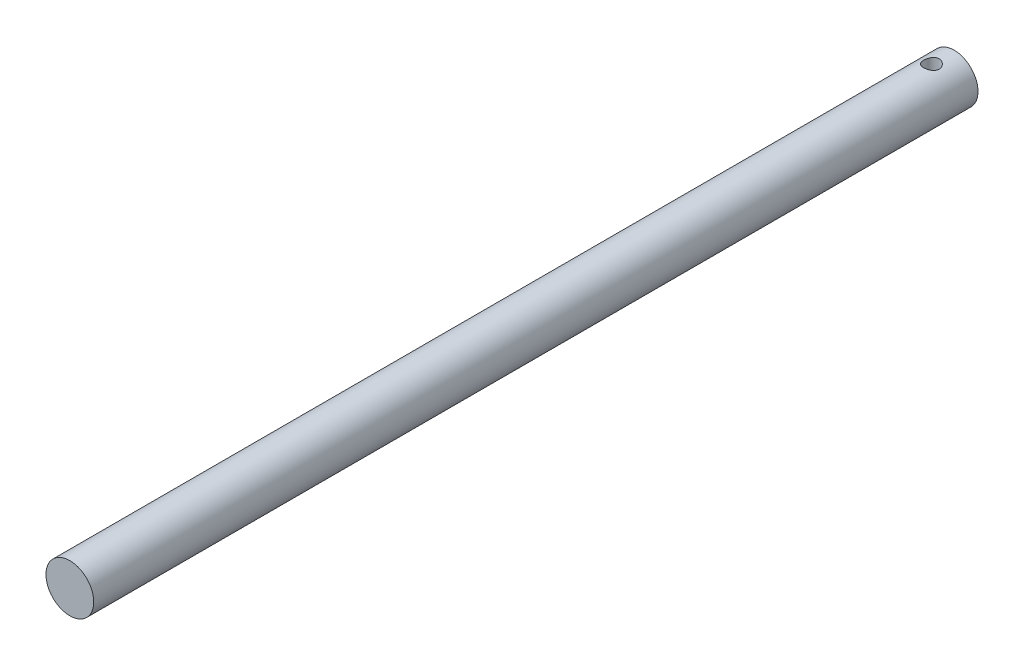
ISO-10303-21;
HEADER;
FILE_DESCRIPTION(('STEP AP214'),'2;1');
FILE_NAME('part.step','',(''),(''),'','','');
FILE_SCHEMA(('AUTOMOTIVE_DESIGN { 1 0 10303 214 1 1 1 1 }'));
ENDSEC;
DATA;
#1=APPLICATION_CONTEXT('core data for automotive mechanical design processes');
#2=APPLICATION_PROTOCOL_DEFINITION('international standard','automotive_design',2000,#1);
#3=PRODUCT_CONTEXT('',#1,'mechanical');
#4=PRODUCT('Part','Part','',(#3));
#5=PRODUCT_RELATED_PRODUCT_CATEGORY('part','',(#4));
#6=PRODUCT_DEFINITION_FORMATION('','',#4);
#7=PRODUCT_DEFINITION_CONTEXT('part definition',#1,'design');
#8=PRODUCT_DEFINITION('design','',#6,#7);
#9=PRODUCT_DEFINITION_SHAPE('','',#8);
#10=(LENGTH_UNIT() NAMED_UNIT(*) SI_UNIT(.MILLI.,.METRE.));
#11=(NAMED_UNIT(*) PLANE_ANGLE_UNIT() SI_UNIT($,.RADIAN.));
#12=(NAMED_UNIT(*) SI_UNIT($,.STERADIAN.) SOLID_ANGLE_UNIT());
#13=UNCERTAINTY_MEASURE_WITH_UNIT(LENGTH_MEASURE(1.E-05),#10,'distance_accuracy_value','');
#14=(GEOMETRIC_REPRESENTATION_CONTEXT(3) GLOBAL_UNCERTAINTY_ASSIGNED_CONTEXT((#13)) GLOBAL_UNIT_ASSIGNED_CONTEXT((#10,
#11,#12)) REPRESENTATION_CONTEXT('',''));
#15=CARTESIAN_POINT('',(0.,0.,0.));
#16=DIRECTION('',(0.,0.,1.));
#17=DIRECTION('',(1.,0.,0.));
#18=AXIS2_PLACEMENT_3D('',#15,#16,#17);
#19=CARTESIAN_POINT('',(0.,0.,370.));
#20=DIRECTION('',(0.,0.,-1.));
#21=DIRECTION('',(-1.,0.,0.));
#22=AXIS2_PLACEMENT_3D('',#19,#20,#21);
#23=CYLINDRICAL_SURFACE('',#22,10.);
#24=CARTESIAN_POINT('',(0.,-10.,12.75));
#25=CARTESIAN_POINT('',(0.177579382949037,-9.99999989374565,12.7499999788935));
#26=CARTESIAN_POINT('',(0.355160799428112,-9.99522579386108,12.7353980365284));
#27=CARTESIAN_POINT('',(0.705108112257464,-9.97665017824227,12.6775443332715));
#28=CARTESIAN_POINT('',(0.877473205641299,-9.96284727999528,12.6342881847613));
#29=CARTESIAN_POINT('',(1.21189182680224,-9.92771716006862,12.5207547728247));
#30=CARTESIAN_POINT('',(1.37396158278686,-9.90640214525769,12.4505213298079));
#31=CARTESIAN_POINT('',(1.68402262402101,-9.85843361438871,12.2852203482162));
#32=CARTESIAN_POINT('',(1.83201134569424,-9.83177912896556,12.1901482993111));
#33=CARTESIAN_POINT('',(2.11461081148199,-9.77495932247796,11.9745589387076));
#34=CARTESIAN_POINT('',(2.24869037174637,-9.74471295358528,11.8533668062036));
#35=CARTESIAN_POINT('',(2.49502344091046,-9.6845736848256,11.5904130339127));
#36=CARTESIAN_POINT('',(2.6072724549812,-9.65468085893924,11.4486471685403));
#37=CARTESIAN_POINT('',(2.80972801137824,-9.59775056049016,11.1438629732491));
#38=CARTESIAN_POINT('',(2.89925504445897,-9.57081237727236,10.9803729502016));
#39=CARTESIAN_POINT('',(3.049318871398,-9.52406830823476,10.6396400997919));
#40=CARTESIAN_POINT('',(3.10986401524675,-9.50426036852437,10.4624012507344));
#41=CARTESIAN_POINT('',(3.19827260971519,-9.4748706234853,10.1052240034781));
#42=CARTESIAN_POINT('',(3.2271274104268,-9.46497952226558,9.92555717035662));
#43=CARTESIAN_POINT('',(3.25443459132067,-9.45562707493594,9.56368104299375));
#44=CARTESIAN_POINT('',(3.25289582251765,-9.45616269242515,9.38147250437639));
#45=CARTESIAN_POINT('',(3.22023155138037,-9.46733131423128,9.02803492164185));
#46=CARTESIAN_POINT('',(3.19038591816139,-9.47752750417874,8.8566714242638));
#47=CARTESIAN_POINT('',(3.10403782395807,-9.50615574812355,8.52153026618225));
#48=CARTESIAN_POINT('',(3.04753231830217,-9.52458874278654,8.35775347425966));
#49=CARTESIAN_POINT('',(2.9086040418874,-9.56793440052134,8.03946972523123));
#50=CARTESIAN_POINT('',(2.82579288678077,-9.59294312913819,7.88514594174321));
#51=CARTESIAN_POINT('',(2.63687365185911,-9.64658062480913,7.59217407032713));
#52=CARTESIAN_POINT('',(2.53075911343127,-9.6752103945125,7.45353034435166));
#53=CARTESIAN_POINT('',(2.29204406554379,-9.73459644737762,7.18864419467052));
#54=CARTESIAN_POINT('',(2.15839298888212,-9.76538786414675,7.06335456075029));
#55=CARTESIAN_POINT('',(1.87159594889807,-9.82438470108506,6.83672493383306));
#56=CARTESIAN_POINT('',(1.71844829781997,-9.85258989700936,6.73538701643118));
#57=CARTESIAN_POINT('',(1.39505996296231,-9.90357541398691,6.55882041963745));
#58=CARTESIAN_POINT('',(1.22467751353947,-9.92630448856869,6.48383558140145));
#59=CARTESIAN_POINT('',(0.872803501369059,-9.96340575158467,6.36388245090137));
#60=CARTESIAN_POINT('',(0.69131562065941,-9.97778069343972,6.31890426808364));
#61=CARTESIAN_POINT('',(0.330457295677714,-9.99610319938068,6.26190268958609));
#62=CARTESIAN_POINT('',(0.151310774152583,-10.0004581918424,6.24859087614171));
#63=CARTESIAN_POINT('',(-0.206684753642986,-9.99946515119833,6.25164499537228));
#64=CARTESIAN_POINT('',(-0.385533802797546,-9.99411866512874,6.26800619627043));
#65=CARTESIAN_POINT('',(-0.732777014929081,-9.97459190888947,6.32891612541361));
#66=CARTESIAN_POINT('',(-0.901323284372865,-9.96065655544011,6.37268387411816));
#67=CARTESIAN_POINT('',(-1.22862125569252,-9.92560343144515,6.48619763987108));
#68=CARTESIAN_POINT('',(-1.38737171915065,-9.90448475494932,6.55594693377962));
#69=CARTESIAN_POINT('',(-1.69509055480488,-9.85654869030637,6.7214272702345));
#70=CARTESIAN_POINT('',(-1.84370519348154,-9.82959944293602,6.8177768248749));
#71=CARTESIAN_POINT('',(-2.12308150730875,-9.77306882676684,7.03298990397325));
#72=CARTESIAN_POINT('',(-2.25383795390917,-9.74348669127606,7.151859997817));
#73=CARTESIAN_POINT('',(-2.49964097258612,-9.68341394517995,7.41480097804423));
#74=CARTESIAN_POINT('',(-2.61376838975716,-9.65293908057767,7.55973674123745));
#75=CARTESIAN_POINT('',(-2.81618275812033,-9.59584349220032,7.86736100265518));
#76=CARTESIAN_POINT('',(-2.90446977360854,-9.56922275883548,8.03004945670606));
#77=CARTESIAN_POINT('',(-3.05222465357593,-9.52312626728824,8.3684525393954));
#78=CARTESIAN_POINT('',(-3.11177462835522,-9.50363019104654,8.54412838046303));
#79=CARTESIAN_POINT('',(-3.20020095668876,-9.47422438151486,8.90378778157255));
#80=CARTESIAN_POINT('',(-3.22909023717128,-9.4643106083648,9.08776780633169));
#81=CARTESIAN_POINT('',(-3.25439854839941,-9.45563586870718,9.44914011744297));
#82=CARTESIAN_POINT('',(-3.25233581624123,-9.45635339998916,9.62641479309743));
#83=CARTESIAN_POINT('',(-3.21950614466644,-9.46758016662914,9.97795399616682));
#84=CARTESIAN_POINT('',(-3.18874075712543,-9.47808887260453,10.1522186858048));
#85=CARTESIAN_POINT('',(-3.10043070730134,-9.50733511912922,10.4898321057282));
#86=CARTESIAN_POINT('',(-3.04335434275121,-9.52592844913925,10.6533167867785));
#87=CARTESIAN_POINT('',(-2.90441722996809,-9.5692021691022,10.9685171754486));
#88=CARTESIAN_POINT('',(-2.82255115849537,-9.59388386623479,11.1202303465038));
#89=CARTESIAN_POINT('',(-2.63235879697991,-9.64784088636398,11.4144561834634));
#90=CARTESIAN_POINT('',(-2.52306891129123,-9.67726517521805,11.5563185213747));
#91=CARTESIAN_POINT('',(-2.28278717900075,-9.73674387050347,11.8201809069832));
#92=CARTESIAN_POINT('',(-2.15178933442872,-9.76679844907541,11.9421754466285));
#93=CARTESIAN_POINT('',(-1.86608754817447,-9.82546252093759,12.1672967982182));
#94=CARTESIAN_POINT('',(-1.71069498742675,-9.85397977542082,12.2695765881428));
#95=CARTESIAN_POINT('',(-1.38400159009725,-9.90514098282108,12.4464406536773));
#96=CARTESIAN_POINT('',(-1.21270574929994,-9.92778677175249,12.5210335901562));
#97=CARTESIAN_POINT('',(-0.869832380696063,-9.96349655119001,12.6363330359905));
#98=CARTESIAN_POINT('',(-0.698908003473846,-9.97706030755102,12.6788273892005));
#99=CARTESIAN_POINT('',(-0.351988917437684,-9.9953110007797,12.7356574435725));
#100=CARTESIAN_POINT('',(-0.175995457426611,-10.0000001053066,12.7500000209183));
#101=CARTESIAN_POINT('',(0.,-10.,12.75));
#102=B_SPLINE_CURVE_WITH_KNOTS('',3,(#24,#25,#26,#27,#28,#29,#30,#31,#32,#33,#34,#35,#36,#37,
#38,#39,#40,#41,#42,#43,#44,#45,#46,#47,#48,#49,#50,#51,#52,#53,#54,#55,#56,#57,#58,#59,#60,#61,
#62,#63,#64,#65,#66,#67,#68,#69,#70,#71,#72,#73,#74,#75,#76,#77,#78,#79,#80,#81,#82,#83,#84,#85,
#86,#87,#88,#89,#90,#91,#92,#93,#94,#95,#96,#97,#98,#99,#100,#101),.UNSPECIFIED.,.T.,.F.,(4,2,2,
2,2,2,2,2,2,2,2,2,2,2,2,2,2,2,2,2,2,2,2,2,2,2,2,2,2,2,2,2,2,2,2,2,2,2,4),(0.,0.532090801254678,
1.06426309669592,1.59557459199055,2.12698263287681,2.67425296309553,3.22163585524026,
3.78384740278184,4.34589687356045,4.88981368187708,5.43357209666657,5.95386117923412,
6.47420969543027,7.0026288286568,7.53119460031028,8.08590846442153,8.64067038102186,
9.2004380558259,9.76002113320907,10.2964148728263,10.8327230844865,11.3544036147969,
11.8761499631049,12.4112318399367,12.9464700445872,13.5047604456698,14.0630494576023,
14.6197336846483,15.176183113382,15.7054311330744,16.2346505394039,16.7547941299287,
17.275049493252,17.8170673976499,18.3592353135956,18.9211107593865,19.4828102935623,
20.0102839458811,20.5376287446081),.UNSPECIFIED.);
#103=CARTESIAN_POINT('',(0.,-10.,12.75));
#104=VERTEX_POINT('',#103);
#105=EDGE_CURVE('E38',#104,#104,#102,.T.);
#106=ORIENTED_EDGE('',*,*,#105,.T.);
#107=EDGE_LOOP('',(#106));
#108=FACE_BOUND('',#107,.T.);
#109=CARTESIAN_POINT('',(0.,10.,12.75));
#110=CARTESIAN_POINT('',(-0.17757938294903,9.99999989374565,12.7499999788935));
#111=CARTESIAN_POINT('',(-0.355160799428105,9.99522579386108,12.7353980365284));
#112=CARTESIAN_POINT('',(-0.705108112257457,9.97665017824228,12.6775443332715));
#113=CARTESIAN_POINT('',(-0.877473205641292,9.96284727999529,12.6342881847613));
#114=CARTESIAN_POINT('',(-1.21189182680223,9.92771716006863,12.5207547728247));
#115=CARTESIAN_POINT('',(-1.37396158278685,9.90640214525769,12.4505213298079));
#116=CARTESIAN_POINT('',(-1.684022624021,9.85843361438871,12.2852203482162));
#117=CARTESIAN_POINT('',(-1.83201134569423,9.83177912896556,12.1901482993111));
#118=CARTESIAN_POINT('',(-2.11461081148198,9.77495932247796,11.9745589387076));
#119=CARTESIAN_POINT('',(-2.24869037174636,9.74471295358528,11.8533668062036));
#120=CARTESIAN_POINT('',(-2.49502344091045,9.6845736848256,11.5904130339127));
#121=CARTESIAN_POINT('',(-2.60727245498119,9.65468085893924,11.4486471685403));
#122=CARTESIAN_POINT('',(-2.80972801137823,9.59775056049016,11.1438629732491));
#123=CARTESIAN_POINT('',(-2.89925504445896,9.57081237727236,10.9803729502016));
#124=CARTESIAN_POINT('',(-3.04931887139799,9.52406830823476,10.6396400997919));
#125=CARTESIAN_POINT('',(-3.10986401524674,9.50426036852437,10.4624012507344));
#126=CARTESIAN_POINT('',(-3.19827260971519,9.4748706234853,10.1052240034781));
#127=CARTESIAN_POINT('',(-3.2271274104268,9.46497952226559,9.92555717035662));
#128=CARTESIAN_POINT('',(-3.25443459132067,9.45562707493594,9.56368104299375));
#129=CARTESIAN_POINT('',(-3.25289582251765,9.45616269242515,9.38147250437639));
#130=CARTESIAN_POINT('',(-3.22023155138037,9.46733131423128,9.02803492164185));
#131=CARTESIAN_POINT('',(-3.19038591816138,9.47752750417874,8.8566714242638));
#132=CARTESIAN_POINT('',(-3.10403782395806,9.50615574812356,8.52153026618225));
#133=CARTESIAN_POINT('',(-3.04753231830216,9.52458874278654,8.35775347425966));
#134=CARTESIAN_POINT('',(-2.90860404188739,9.56793440052134,8.03946972523123));
#135=CARTESIAN_POINT('',(-2.82579288678076,9.5929431291382,7.88514594174321));
#136=CARTESIAN_POINT('',(-2.6368736518591,9.64658062480913,7.59217407032713));
#137=CARTESIAN_POINT('',(-2.53075911343127,9.6752103945125,7.45353034435166));
#138=CARTESIAN_POINT('',(-2.29204406554378,9.73459644737762,7.18864419467052));
#139=CARTESIAN_POINT('',(-2.15839298888211,9.76538786414675,7.06335456075029));
#140=CARTESIAN_POINT('',(-1.87159594889806,9.82438470108506,6.83672493383306));
#141=CARTESIAN_POINT('',(-1.71844829781996,9.85258989700936,6.73538701643118));
#142=CARTESIAN_POINT('',(-1.3950599629623,9.90357541398691,6.55882041963745));
#143=CARTESIAN_POINT('',(-1.22467751353946,9.92630448856869,6.48383558140145));
#144=CARTESIAN_POINT('',(-0.872803501369051,9.96340575158467,6.36388245090137));
#145=CARTESIAN_POINT('',(-0.691315620659402,9.97778069343972,6.31890426808364));
#146=CARTESIAN_POINT('',(-0.330457295677706,9.99610319938068,6.26190268958609));
#147=CARTESIAN_POINT('',(-0.151310774152576,10.0004581918424,6.24859087614171));
#148=CARTESIAN_POINT('',(0.206684753642994,9.99946515119833,6.25164499537228));
#149=CARTESIAN_POINT('',(0.385533802797554,9.99411866512873,6.26800619627043));
#150=CARTESIAN_POINT('',(0.732777014929089,9.97459190888947,6.32891612541361));
#151=CARTESIAN_POINT('',(0.901323284372872,9.96065655544011,6.37268387411816));
#152=CARTESIAN_POINT('',(1.22862125569253,9.92560343144515,6.48619763987108));
#153=CARTESIAN_POINT('',(1.38737171915066,9.90448475494932,6.55594693377962));
#154=CARTESIAN_POINT('',(1.69509055480489,9.85654869030636,6.7214272702345));
#155=CARTESIAN_POINT('',(1.84370519348155,9.82959944293601,6.8177768248749));
#156=CARTESIAN_POINT('',(2.12308150730875,9.77306882676684,7.03298990397325));
#157=CARTESIAN_POINT('',(2.25383795390918,9.74348669127605,7.151859997817));
#158=CARTESIAN_POINT('',(2.49964097258612,9.68341394517995,7.41480097804423));
#159=CARTESIAN_POINT('',(2.61376838975717,9.65293908057767,7.55973674123745));
#160=CARTESIAN_POINT('',(2.81618275812033,9.59584349220032,7.86736100265518));
#161=CARTESIAN_POINT('',(2.90446977360854,9.56922275883548,8.03004945670606));
#162=CARTESIAN_POINT('',(3.05222465357594,9.52312626728824,8.3684525393954));
#163=CARTESIAN_POINT('',(3.11177462835522,9.50363019104654,8.54412838046303));
#164=CARTESIAN_POINT('',(3.20020095668876,9.47422438151486,8.90378778157254));
#165=CARTESIAN_POINT('',(3.22909023717129,9.4643106083648,9.08776780633168));
#166=CARTESIAN_POINT('',(3.25439854839942,9.45563586870717,9.44914011744297));
#167=CARTESIAN_POINT('',(3.25233581624124,9.45635339998916,9.62641479309743));
#168=CARTESIAN_POINT('',(3.21950614466645,9.46758016662914,9.97795399616682));
#169=CARTESIAN_POINT('',(3.18874075712544,9.47808887260453,10.1522186858048));
#170=CARTESIAN_POINT('',(3.10043070730134,9.50733511912922,10.4898321057282));
#171=CARTESIAN_POINT('',(3.04335434275122,9.52592844913925,10.6533167867785));
#172=CARTESIAN_POINT('',(2.9044172299681,9.56920216910219,10.9685171754486));
#173=CARTESIAN_POINT('',(2.82255115849538,9.59388386623479,11.1202303465038));
#174=CARTESIAN_POINT('',(2.63235879697992,9.64784088636397,11.4144561834634));
#175=CARTESIAN_POINT('',(2.52306891129124,9.67726517521804,11.5563185213747));
#176=CARTESIAN_POINT('',(2.28278717900076,9.73674387050347,11.8201809069832));
#177=CARTESIAN_POINT('',(2.15178933442872,9.76679844907541,11.9421754466285));
#178=CARTESIAN_POINT('',(1.86608754817448,9.82546252093759,12.1672967982182));
#179=CARTESIAN_POINT('',(1.71069498742676,9.85397977542082,12.2695765881428));
#180=CARTESIAN_POINT('',(1.38400159009726,9.90514098282108,12.4464406536773));
#181=CARTESIAN_POINT('',(1.21270574929995,9.92778677175249,12.5210335901562));
#182=CARTESIAN_POINT('',(0.869832380696071,9.96349655119002,12.6363330359905));
#183=CARTESIAN_POINT('',(0.698908003473853,9.97706030755102,12.6788273892005));
#184=CARTESIAN_POINT('',(0.351988917437691,9.9953110007797,12.7356574435725));
#185=CARTESIAN_POINT('',(0.175995457426618,10.0000001053066,12.7500000209183));
#186=CARTESIAN_POINT('',(0.,10.,12.75));
#187=B_SPLINE_CURVE_WITH_KNOTS('',3,(#109,#110,#111,#112,#113,#114,#115,#116,#117,#118,#119,
#120,#121,#122,#123,#124,#125,#126,#127,#128,#129,#130,#131,#132,#133,#134,#135,#136,#137,#138,
#139,#140,#141,#142,#143,#144,#145,#146,#147,#148,#149,#150,#151,#152,#153,#154,#155,#156,#157,
#158,#159,#160,#161,#162,#163,#164,#165,#166,#167,#168,#169,#170,#171,#172,#173,#174,#175,#176,
#177,#178,#179,#180,#181,#182,#183,#184,#185,#186),.UNSPECIFIED.,.T.,.F.,(4,2,2,2,2,2,2,2,2,2,2,
2,2,2,2,2,2,2,2,2,2,2,2,2,2,2,2,2,2,2,2,2,2,2,2,2,2,2,4),(0.,0.532090801254678,1.06426309669592,
1.59557459199055,2.12698263287681,2.67425296309553,3.22163585524026,3.78384740278184,
4.34589687356045,4.88981368187708,5.43357209666657,5.95386117923412,6.47420969543027,
7.0026288286568,7.53119460031028,8.08590846442153,8.64067038102186,9.2004380558259,
9.76002113320907,10.2964148728263,10.8327230844865,11.3544036147969,11.8761499631049,
12.4112318399367,12.9464700445872,13.5047604456698,14.0630494576023,14.6197336846483,
15.176183113382,15.7054311330744,16.2346505394039,16.7547941299287,17.275049493252,
17.8170673976499,18.3592353135956,18.9211107593865,19.4828102935623,20.0102839458811,
20.5376287446081),.UNSPECIFIED.);
#188=CARTESIAN_POINT('',(0.,10.,12.75));
#189=VERTEX_POINT('',#188);
#190=EDGE_CURVE('E52',#189,#189,#187,.T.);
#191=ORIENTED_EDGE('',*,*,#190,.T.);
#192=EDGE_LOOP('',(#191));
#193=FACE_BOUND('',#192,.T.);
#194=CARTESIAN_POINT('',(0.,0.,370.));
#195=DIRECTION('',(0.,0.,1.));
#196=DIRECTION('',(1.,0.,0.));
#197=AXIS2_PLACEMENT_3D('',#194,#195,#196);
#198=CIRCLE('',#197,10.);
#199=CARTESIAN_POINT('',(10.,0.,370.));
#200=VERTEX_POINT('',#199);
#201=EDGE_CURVE('E10',#200,#200,#198,.T.);
#202=ORIENTED_EDGE('',*,*,#201,.F.);
#203=EDGE_LOOP('',(#202));
#204=FACE_BOUND('',#203,.T.);
#205=CARTESIAN_POINT('',(0.,0.,0.));
#206=DIRECTION('',(0.,0.,1.));
#207=DIRECTION('',(1.,0.,0.));
#208=AXIS2_PLACEMENT_3D('',#205,#206,#207);
#209=CIRCLE('',#208,10.);
#210=CARTESIAN_POINT('',(10.,0.,0.));
#211=VERTEX_POINT('',#210);
#212=EDGE_CURVE('E46',#211,#211,#209,.T.);
#213=ORIENTED_EDGE('',*,*,#212,.T.);
#214=EDGE_LOOP('',(#213));
#215=FACE_BOUND('',#214,.T.);
#216=ADVANCED_FACE('F34',(#108,#193,#204,#215),#23,.T.);
#217=CARTESIAN_POINT('',(0.,0.,370.));
#218=DIRECTION('',(0.,0.,1.));
#219=DIRECTION('',(1.,0.,0.));
#220=AXIS2_PLACEMENT_3D('',#217,#218,#219);
#221=PLANE('',#220);
#222=ORIENTED_EDGE('',*,*,#201,.T.);
#223=EDGE_LOOP('',(#222));
#224=FACE_BOUND('',#223,.T.);
#225=ADVANCED_FACE('F63',(#224),#221,.T.);
#226=CARTESIAN_POINT('',(0.,0.,0.));
#227=DIRECTION('',(0.,0.,1.));
#228=DIRECTION('',(1.,0.,0.));
#229=AXIS2_PLACEMENT_3D('',#226,#227,#228);
#230=PLANE('',#229);
#231=ORIENTED_EDGE('',*,*,#212,.F.);
#232=EDGE_LOOP('',(#231));
#233=FACE_BOUND('',#232,.T.);
#234=ADVANCED_FACE('F61',(#233),#230,.F.);
#235=CARTESIAN_POINT('',(0.,-210.,9.5));
#236=DIRECTION('',(0.,1.,0.));
#237=DIRECTION('',(0.,0.,1.));
#238=AXIS2_PLACEMENT_3D('',#235,#236,#237);
#239=CYLINDRICAL_SURFACE('',#238,3.25);
#240=ORIENTED_EDGE('',*,*,#190,.F.);
#241=EDGE_LOOP('',(#240));
#242=FACE_BOUND('',#241,.T.);
#243=ORIENTED_EDGE('',*,*,#105,.F.);
#244=EDGE_LOOP('',(#243));
#245=FACE_BOUND('',#244,.T.);
#246=ADVANCED_FACE('F57',(#242,#245),#239,.F.);
#247=CLOSED_SHELL('',(#216,#225,#234,#246));
#248=MANIFOLD_SOLID_BREP('B2',#247);
#249=ADVANCED_BREP_SHAPE_REPRESENTATION('',(#18,#248),#14);
#250=SHAPE_DEFINITION_REPRESENTATION(#9,#249);
ENDSEC;
END-ISO-10303-21;
